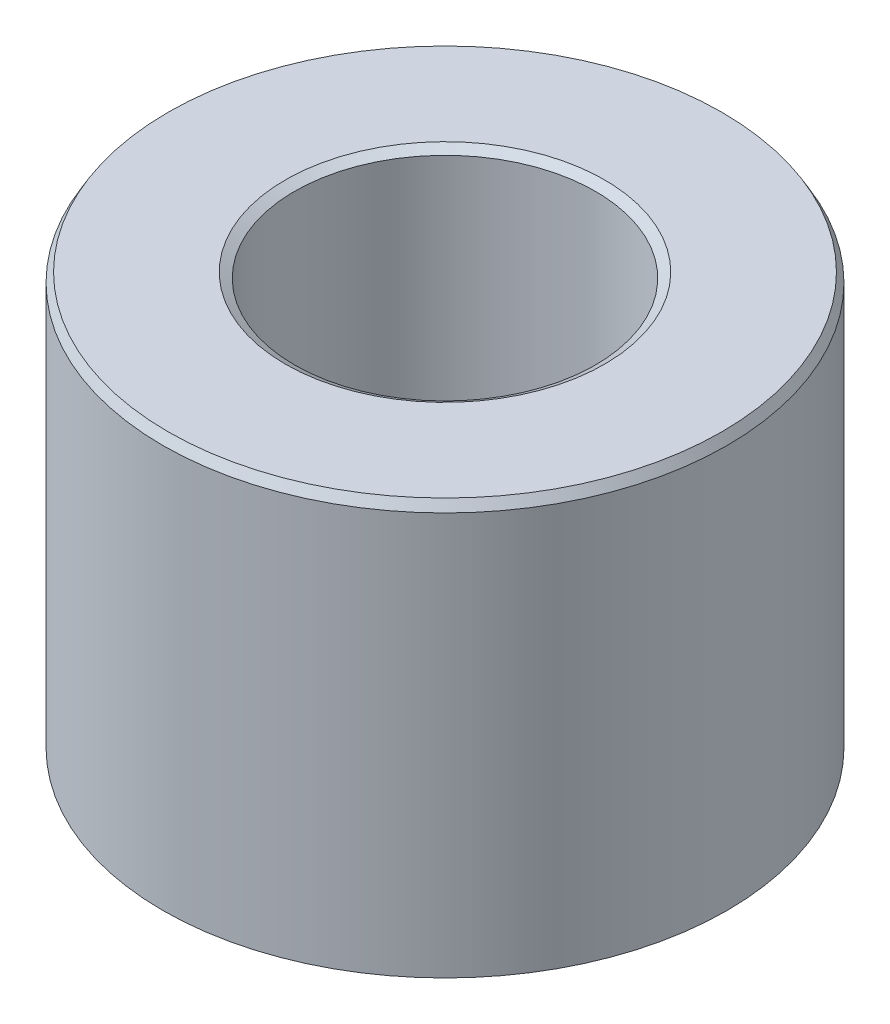
ISO-10303-21;
HEADER;
FILE_DESCRIPTION(('STEP AP214'),'2;1');
FILE_NAME('part.step','',(''),(''),'','','');
FILE_SCHEMA(('AUTOMOTIVE_DESIGN { 1 0 10303 214 1 1 1 1 }'));
ENDSEC;
DATA;
#1=APPLICATION_CONTEXT('core data for automotive mechanical design processes');
#2=APPLICATION_PROTOCOL_DEFINITION('international standard','automotive_design',2000,#1);
#3=PRODUCT_CONTEXT('',#1,'mechanical');
#4=PRODUCT('Part','Part','',(#3));
#5=PRODUCT_RELATED_PRODUCT_CATEGORY('part','',(#4));
#6=PRODUCT_DEFINITION_FORMATION('','',#4);
#7=PRODUCT_DEFINITION_CONTEXT('part definition',#1,'design');
#8=PRODUCT_DEFINITION('design','',#6,#7);
#9=PRODUCT_DEFINITION_SHAPE('','',#8);
#10=(LENGTH_UNIT() NAMED_UNIT(*) SI_UNIT(.MILLI.,.METRE.));
#11=(NAMED_UNIT(*) PLANE_ANGLE_UNIT() SI_UNIT($,.RADIAN.));
#12=(NAMED_UNIT(*) SI_UNIT($,.STERADIAN.) SOLID_ANGLE_UNIT());
#13=UNCERTAINTY_MEASURE_WITH_UNIT(LENGTH_MEASURE(1.E-05),#10,'distance_accuracy_value','');
#14=(GEOMETRIC_REPRESENTATION_CONTEXT(3) GLOBAL_UNCERTAINTY_ASSIGNED_CONTEXT((#13)) GLOBAL_UNIT_ASSIGNED_CONTEXT((#10,
#11,#12)) REPRESENTATION_CONTEXT('',''));
#15=CARTESIAN_POINT('',(0.,0.,0.));
#16=DIRECTION('',(0.,0.,1.));
#17=DIRECTION('',(1.,0.,0.));
#18=AXIS2_PLACEMENT_3D('',#15,#16,#17);
#19=CARTESIAN_POINT('',(0.,59.1531757161048,0.));
#20=DIRECTION('',(0.,-1.,0.));
#21=DIRECTION('',(0.,0.,-1.));
#22=AXIS2_PLACEMENT_3D('',#19,#20,#21);
#23=CYLINDRICAL_SURFACE('',#22,40.);
#24=CARTESIAN_POINT('',(0.,0.752338956658293,0.));
#25=DIRECTION('',(0.,1.,0.));
#26=DIRECTION('',(0.,0.,1.));
#27=AXIS2_PLACEMENT_3D('',#24,#25,#26);
#28=CIRCLE('',#27,40.);
#29=CARTESIAN_POINT('',(0.,0.752338956658293,40.));
#30=VERTEX_POINT('',#29);
#31=EDGE_CURVE('E10',#30,#30,#28,.T.);
#32=ORIENTED_EDGE('',*,*,#31,.T.);
#33=EDGE_LOOP('',(#32));
#34=FACE_BOUND('',#33,.T.);
#35=CARTESIAN_POINT('',(0.,57.8500864186592,0.));
#36=DIRECTION('',(0.,1.,0.));
#37=DIRECTION('',(0.,0.,1.));
#38=AXIS2_PLACEMENT_3D('',#35,#36,#37);
#39=CIRCLE('',#38,40.);
#40=CARTESIAN_POINT('',(0.,57.8500864186592,-40.));
#41=VERTEX_POINT('',#40);
#42=EDGE_CURVE('E50',#41,#41,#39,.F.);
#43=ORIENTED_EDGE('',*,*,#42,.T.);
#44=EDGE_LOOP('',(#43));
#45=FACE_BOUND('',#44,.T.);
#46=ADVANCED_FACE('F39',(#34,#45),#23,.T.);
#47=CARTESIAN_POINT('',(0.,59.1531757161048,0.));
#48=DIRECTION('',(0.,1.,0.));
#49=DIRECTION('',(0.,0.,1.));
#50=AXIS2_PLACEMENT_3D('',#47,#48,#49);
#51=PLANE('',#50);
#52=CARTESIAN_POINT('',(0.,59.1531757161048,0.));
#53=DIRECTION('',(0.,1.,0.));
#54=DIRECTION('',(0.,0.,1.));
#55=AXIS2_PLACEMENT_3D('',#52,#53,#54);
#56=CIRCLE('',#55,22.6349293405083);
#57=CARTESIAN_POINT('',(0.,59.1531757161048,22.6349293405083));
#58=VERTEX_POINT('',#57);
#59=EDGE_CURVE('E58',#58,#58,#56,.F.);
#60=ORIENTED_EDGE('',*,*,#59,.T.);
#61=EDGE_LOOP('',(#60));
#62=FACE_BOUND('',#61,.T.);
#63=CARTESIAN_POINT('',(0.,59.1531757161048,0.));
#64=DIRECTION('',(0.,1.,0.));
#65=DIRECTION('',(0.,0.,1.));
#66=AXIS2_PLACEMENT_3D('',#63,#64,#65);
#67=CIRCLE('',#66,39.2476610433417);
#68=CARTESIAN_POINT('',(0.,59.1531757161048,-39.2476610433417));
#69=VERTEX_POINT('',#68);
#70=EDGE_CURVE('E61',#69,#69,#67,.T.);
#71=ORIENTED_EDGE('',*,*,#70,.T.);
#72=EDGE_LOOP('',(#71));
#73=FACE_BOUND('',#72,.T.);
#74=ADVANCED_FACE('F88',(#62,#73),#51,.T.);
#75=CARTESIAN_POINT('',(0.,0.,0.));
#76=DIRECTION('',(0.,1.,0.));
#77=DIRECTION('',(0.,0.,1.));
#78=AXIS2_PLACEMENT_3D('',#75,#76,#77);
#79=PLANE('',#78);
#80=CARTESIAN_POINT('',(0.,0.,0.));
#81=DIRECTION('',(0.,1.,0.));
#82=DIRECTION('',(0.,0.,1.));
#83=AXIS2_PLACEMENT_3D('',#80,#81,#82);
#84=CIRCLE('',#83,22.084178999721);
#85=CARTESIAN_POINT('',(0.,0.,22.084178999721));
#86=VERTEX_POINT('',#85);
#87=EDGE_CURVE('E51',#86,#86,#84,.T.);
#88=ORIENTED_EDGE('',*,*,#87,.T.);
#89=EDGE_LOOP('',(#88));
#90=FACE_BOUND('',#89,.T.);
#91=CARTESIAN_POINT('',(0.,0.,0.));
#92=DIRECTION('',(0.,1.,0.));
#93=DIRECTION('',(0.,0.,1.));
#94=AXIS2_PLACEMENT_3D('',#91,#92,#93);
#95=CIRCLE('',#94,38.6969107025545);
#96=CARTESIAN_POINT('',(0.,0.,38.6969107025545));
#97=VERTEX_POINT('',#96);
#98=EDGE_CURVE('E54',#97,#97,#95,.F.);
#99=ORIENTED_EDGE('',*,*,#98,.T.);
#100=EDGE_LOOP('',(#99));
#101=FACE_BOUND('',#100,.T.);
#102=ADVANCED_FACE('F83',(#90,#101),#79,.F.);
#103=CARTESIAN_POINT('',(0.,59.1531757161048,0.));
#104=DIRECTION('',(0.,-1.,0.));
#105=DIRECTION('',(0.,0.,-1.));
#106=AXIS2_PLACEMENT_3D('',#103,#104,#105);
#107=CYLINDRICAL_SURFACE('',#106,21.3318400430627);
#108=CARTESIAN_POINT('',(0.,58.4008367594465,0.));
#109=DIRECTION('',(0.,1.,0.));
#110=DIRECTION('',(0.,0.,1.));
#111=AXIS2_PLACEMENT_3D('',#108,#109,#110);
#112=CIRCLE('',#111,21.3318400430627);
#113=CARTESIAN_POINT('',(0.,58.4008367594465,21.3318400430627));
#114=VERTEX_POINT('',#113);
#115=EDGE_CURVE('E67',#114,#114,#112,.T.);
#116=ORIENTED_EDGE('',*,*,#115,.T.);
#117=EDGE_LOOP('',(#116));
#118=FACE_BOUND('',#117,.T.);
#119=CARTESIAN_POINT('',(0.,1.30308929744555,0.));
#120=DIRECTION('',(0.,1.,0.));
#121=DIRECTION('',(0.,0.,1.));
#122=AXIS2_PLACEMENT_3D('',#119,#120,#121);
#123=CIRCLE('',#122,21.3318400430627);
#124=CARTESIAN_POINT('',(0.,1.30308929744555,21.3318400430627));
#125=VERTEX_POINT('',#124);
#126=EDGE_CURVE('E69',#125,#125,#123,.F.);
#127=ORIENTED_EDGE('',*,*,#126,.T.);
#128=EDGE_LOOP('',(#127));
#129=FACE_BOUND('',#128,.T.);
#130=ADVANCED_FACE('F71',(#118,#129),#107,.F.);
#131=CARTESIAN_POINT('',(0.,58.4008367594465,0.));
#132=DIRECTION('',(0.,1.,0.));
#133=DIRECTION('',(0.,0.,1.));
#134=AXIS2_PLACEMENT_3D('',#131,#132,#133);
#135=CONICAL_SURFACE('',#134,21.3318400430627,1.0471975511966);
#136=CARTESIAN_POINT('',(0.,59.1531757161048,22.6349293405083));
#137=CARTESIAN_POINT('',(0.,59.145338851973,22.6213554936599));
#138=CARTESIAN_POINT('',(0.,59.1375019878411,22.6077816468115));
#139=CARTESIAN_POINT('',(0.,59.1218282595774,22.5806339531147));
#140=CARTESIAN_POINT('',(0.,59.1139913954455,22.5670601062663));
#141=CARTESIAN_POINT('',(0.,59.0983176671818,22.5399124125696));
#142=CARTESIAN_POINT('',(0.,59.0904808030499,22.5263385657212));
#143=CARTESIAN_POINT('',(0.,59.0748070747862,22.4991908720244));
#144=CARTESIAN_POINT('',(0.,59.0669702106544,22.485617025176));
#145=CARTESIAN_POINT('',(0.,59.0512964823907,22.4584693314792));
#146=CARTESIAN_POINT('',(0.,59.0434596182588,22.4448954846308));
#147=CARTESIAN_POINT('',(0.,59.0277858899951,22.417747790934));
#148=CARTESIAN_POINT('',(0.,59.0199490258632,22.4041739440856));
#149=CARTESIAN_POINT('',(0.,59.0042752975995,22.3770262503889));
#150=CARTESIAN_POINT('',(0.,58.9964384334677,22.3634524035405));
#151=CARTESIAN_POINT('',(0.,58.9807647052039,22.3363047098437));
#152=CARTESIAN_POINT('',(0.,58.9729278410721,22.3227308629953));
#153=CARTESIAN_POINT('',(0.,58.9572541128084,22.2955831692985));
#154=CARTESIAN_POINT('',(0.,58.9494172486765,22.2820093224501));
#155=CARTESIAN_POINT('',(0.,58.9337435204128,22.2548616287533));
#156=CARTESIAN_POINT('',(0.,58.9259066562809,22.2412877819049));
#157=CARTESIAN_POINT('',(0.,58.9102329280172,22.2141400882082));
#158=CARTESIAN_POINT('',(0.,58.9023960638854,22.2005662413598));
#159=CARTESIAN_POINT('',(0.,58.8867223356216,22.173418547663));
#160=CARTESIAN_POINT('',(0.,58.8788854714898,22.1598447008146));
#161=CARTESIAN_POINT('',(0.,58.8632117432261,22.1326970071178));
#162=CARTESIAN_POINT('',(0.,58.8553748790942,22.1191231602694));
#163=CARTESIAN_POINT('',(0.,58.8397011508305,22.0919754665726));
#164=CARTESIAN_POINT('',(0.,58.8318642866987,22.0784016197242));
#165=CARTESIAN_POINT('',(0.,58.8161905584349,22.0512539260275));
#166=CARTESIAN_POINT('',(0.,58.8083536943031,22.0376800791791));
#167=CARTESIAN_POINT('',(0.,58.7926799660394,22.0105323854823));
#168=CARTESIAN_POINT('',(0.,58.7848431019075,21.9969585386339));
#169=CARTESIAN_POINT('',(0.,58.7691693736438,21.9698108449371));
#170=CARTESIAN_POINT('',(0.,58.7613325095119,21.9562369980887));
#171=CARTESIAN_POINT('',(0.,58.7456587812482,21.9290893043919));
#172=CARTESIAN_POINT('',(0.,58.7378219171164,21.9155154575435));
#173=CARTESIAN_POINT('',(0.,58.7221481888526,21.8883677638468));
#174=CARTESIAN_POINT('',(0.,58.7143113247208,21.8747939169984));
#175=CARTESIAN_POINT('',(0.,58.6986375964571,21.8476462233016));
#176=CARTESIAN_POINT('',(0.,58.6908007323252,21.8340723764532));
#177=CARTESIAN_POINT('',(0.,58.6751270040615,21.8069246827564));
#178=CARTESIAN_POINT('',(0.,58.6672901399296,21.793350835908));
#179=CARTESIAN_POINT('',(0.,58.6516164116659,21.7662031422112));
#180=CARTESIAN_POINT('',(0.,58.6437795475341,21.7526292953629));
#181=CARTESIAN_POINT('',(0.,58.6281058192704,21.7254816016661));
#182=CARTESIAN_POINT('',(0.,58.6202689551385,21.7119077548177));
#183=CARTESIAN_POINT('',(0.,58.6045952268748,21.6847600611209));
#184=CARTESIAN_POINT('',(0.,58.5967583627429,21.6711862142725));
#185=CARTESIAN_POINT('',(0.,58.5810846344792,21.6440385205757));
#186=CARTESIAN_POINT('',(0.,58.5732477703474,21.6304646737273));
#187=CARTESIAN_POINT('',(0.,58.5575740420836,21.6033169800305));
#188=CARTESIAN_POINT('',(0.,58.5497371779518,21.5897431331822));
#189=CARTESIAN_POINT('',(0.,58.5340634496881,21.5625954394854));
#190=CARTESIAN_POINT('',(0.,58.5262265855562,21.549021592637));
#191=CARTESIAN_POINT('',(0.,58.5105528572925,21.5218738989402));
#192=CARTESIAN_POINT('',(0.,58.5027159931606,21.5083000520918));
#193=CARTESIAN_POINT('',(0.,58.4870422648969,21.481152358395));
#194=CARTESIAN_POINT('',(0.,58.4792054007651,21.4675785115466));
#195=CARTESIAN_POINT('',(0.,58.4635316725014,21.4404308178498));
#196=CARTESIAN_POINT('',(0.,58.4556948083695,21.4268569710015));
#197=CARTESIAN_POINT('',(0.,58.4400210801058,21.3997092773047));
#198=CARTESIAN_POINT('',(0.,58.4321842159739,21.3861354304563));
#199=CARTESIAN_POINT('',(0.,58.4165104877102,21.3589877367595));
#200=CARTESIAN_POINT('',(0.,58.4086736235784,21.3454138899111));
#201=CARTESIAN_POINT('',(0.,58.4008367594465,21.3318400430627));
#202=B_SPLINE_CURVE_WITH_KNOTS('',3,(#136,#137,#138,#139,#140,#141,#142,#143,#144,#145,#146,
#147,#148,#149,#150,#151,#152,#153,#154,#155,#156,#157,#158,#159,#160,#161,#162,#163,#164,#165,
#166,#167,#168,#169,#170,#171,#172,#173,#174,#175,#176,#177,#178,#179,#180,#181,#182,#183,#184,
#185,#186,#187,#188,#189,#190,#191,#192,#193,#194,#195,#196,#197,#198,#199,#200,#201),
.UNSPECIFIED.,.F.,.F.,(4,2,2,2,2,2,2,2,2,2,2,2,2,2,2,2,2,2,2,2,2,2,2,2,2,2,2,2,2,2,2,2,4),(0.,
0.0470211847911439,0.0940423695822908,0.141063554373438,0.188084739164581,0.235105923955728,
0.282127108746872,0.329148293538015,0.376169478329162,0.423190663120309,0.470211847911449,
0.517233032702596,0.564254217493743,0.611275402284887,0.658296587076033,0.705317771867177,
0.752338956658321,0.799360141449468,0.846381326240614,0.893402511031758,0.940423695822902,
0.987444880614049,1.0344660654052,1.08148725019634,1.12850843498748,1.17552961977863,
1.22255080456977,1.26957198936092,1.31659317415207,1.36361435894321,1.41063554373435,
1.4576567285255,1.50467791331665),.UNSPECIFIED.);
#203=EDGE_CURVE('BSEAM77',#58,#114,#202,.T.);
#204=ORIENTED_EDGE('',*,*,#59,.F.);
#205=ORIENTED_EDGE('',*,*,#115,.F.);
#206=ORIENTED_EDGE('',*,*,#203,.T.);
#207=ORIENTED_EDGE('',*,*,#203,.F.);
#208=EDGE_LOOP('',(#204,#206,#205,#207));
#209=FACE_BOUND('',#208,.T.);
#210=ADVANCED_FACE('F77',(#209),#135,.F.);
#211=CARTESIAN_POINT('',(0.,0.,0.));
#212=DIRECTION('',(0.,-1.,0.));
#213=DIRECTION('',(0.,0.,-1.));
#214=AXIS2_PLACEMENT_3D('',#211,#212,#213);
#215=CONICAL_SURFACE('',#214,22.084178999721,0.523598775598298);
#216=ORIENTED_EDGE('',*,*,#126,.F.);
#217=EDGE_LOOP('',(#216));
#218=FACE_BOUND('',#217,.T.);
#219=ORIENTED_EDGE('',*,*,#87,.F.);
#220=EDGE_LOOP('',(#219));
#221=FACE_BOUND('',#220,.T.);
#222=ADVANCED_FACE('F73',(#218,#221),#215,.F.);
#223=CARTESIAN_POINT('',(0.,0.752338956658293,0.));
#224=DIRECTION('',(0.,1.,0.));
#225=DIRECTION('',(0.,0.,1.));
#226=AXIS2_PLACEMENT_3D('',#223,#224,#225);
#227=CONICAL_SURFACE('',#226,40.,1.0471975511966);
#228=ORIENTED_EDGE('',*,*,#98,.F.);
#229=EDGE_LOOP('',(#228));
#230=FACE_BOUND('',#229,.T.);
#231=ORIENTED_EDGE('',*,*,#31,.F.);
#232=EDGE_LOOP('',(#231));
#233=FACE_BOUND('',#232,.T.);
#234=ADVANCED_FACE('F76',(#230,#233),#227,.T.);
#235=CARTESIAN_POINT('',(0.,59.1531757161048,0.));
#236=DIRECTION('',(0.,-1.,0.));
#237=DIRECTION('',(0.,0.,-1.));
#238=AXIS2_PLACEMENT_3D('',#235,#236,#237);
#239=CONICAL_SURFACE('',#238,39.2476610433417,0.52359877559829);
#240=CARTESIAN_POINT('',(0.,57.8500864186592,-40.));
#241=CARTESIAN_POINT('',(0.,57.8636602655076,-39.9921631358681));
#242=CARTESIAN_POINT('',(0.,57.877234112356,-39.9843262717363));
#243=CARTESIAN_POINT('',(0.,57.9043818060528,-39.9686525434726));
#244=CARTESIAN_POINT('',(0.,57.9179556529012,-39.9608156793407));
#245=CARTESIAN_POINT('',(0.,57.9451033465979,-39.945141951077));
#246=CARTESIAN_POINT('',(0.,57.9586771934463,-39.9373050869451));
#247=CARTESIAN_POINT('',(0.,57.9858248871431,-39.9216313586814));
#248=CARTESIAN_POINT('',(0.,57.9993987339915,-39.9137944945496));
#249=CARTESIAN_POINT('',(0.,58.0265464276883,-39.8981207662859));
#250=CARTESIAN_POINT('',(0.,58.0401202745367,-39.890283902154));
#251=CARTESIAN_POINT('',(0.,58.0672679682335,-39.8746101738903));
#252=CARTESIAN_POINT('',(0.,58.0808418150819,-39.8667733097584));
#253=CARTESIAN_POINT('',(0.,58.1079895087787,-39.8510995814947));
#254=CARTESIAN_POINT('',(0.,58.121563355627,-39.8432627173629));
#255=CARTESIAN_POINT('',(0.,58.1487110493238,-39.8275889890991));
#256=CARTESIAN_POINT('',(0.,58.1622848961722,-39.8197521249673));
#257=CARTESIAN_POINT('',(0.,58.189432589869,-39.8040783967036));
#258=CARTESIAN_POINT('',(0.,58.2030064367174,-39.7962415325717));
#259=CARTESIAN_POINT('',(0.,58.2301541304142,-39.780567804308));
#260=CARTESIAN_POINT('',(0.,58.2437279772626,-39.7727309401761));
#261=CARTESIAN_POINT('',(0.,58.2708756709593,-39.7570572119124));
#262=CARTESIAN_POINT('',(0.,58.2844495178077,-39.7492203477806));
#263=CARTESIAN_POINT('',(0.,58.3115972115045,-39.7335466195169));
#264=CARTESIAN_POINT('',(0.,58.3251710583529,-39.725709755385));
#265=CARTESIAN_POINT('',(0.,58.3523187520497,-39.7100360271213));
#266=CARTESIAN_POINT('',(0.,58.3658925988981,-39.7021991629894));
#267=CARTESIAN_POINT('',(0.,58.3930402925949,-39.6865254347257));
#268=CARTESIAN_POINT('',(0.,58.4066141394433,-39.6786885705938));
#269=CARTESIAN_POINT('',(0.,58.4337618331401,-39.6630148423301));
#270=CARTESIAN_POINT('',(0.,58.4473356799884,-39.6551779781983));
#271=CARTESIAN_POINT('',(0.,58.4744833736852,-39.6395042499346));
#272=CARTESIAN_POINT('',(0.,58.4880572205336,-39.6316673858027));
#273=CARTESIAN_POINT('',(0.,58.5152049142304,-39.615993657539));
#274=CARTESIAN_POINT('',(0.,58.5287787610788,-39.6081567934071));
#275=CARTESIAN_POINT('',(0.,58.5559264547756,-39.5924830651434));
#276=CARTESIAN_POINT('',(0.,58.569500301624,-39.5846462010116));
#277=CARTESIAN_POINT('',(0.,58.5966479953208,-39.5689724727478));
#278=CARTESIAN_POINT('',(0.,58.6102218421691,-39.561135608616));
#279=CARTESIAN_POINT('',(0.,58.6373695358659,-39.5454618803523));
#280=CARTESIAN_POINT('',(0.,58.6509433827143,-39.5376250162204));
#281=CARTESIAN_POINT('',(0.,58.6780910764111,-39.5219512879567));
#282=CARTESIAN_POINT('',(0.,58.6916649232595,-39.5141144238248));
#283=CARTESIAN_POINT('',(0.,58.7188126169563,-39.4984406955611));
#284=CARTESIAN_POINT('',(0.,58.7323864638047,-39.4906038314293));
#285=CARTESIAN_POINT('',(0.,58.7595341575014,-39.4749301031655));
#286=CARTESIAN_POINT('',(0.,58.7731080043498,-39.4670932390337));
#287=CARTESIAN_POINT('',(0.,58.8002556980466,-39.45141951077));
#288=CARTESIAN_POINT('',(0.,58.813829544895,-39.4435826466381));
#289=CARTESIAN_POINT('',(0.,58.8409772385918,-39.4279089183744));
#290=CARTESIAN_POINT('',(0.,58.8545510854402,-39.4200720542425));
#291=CARTESIAN_POINT('',(0.,58.881698779137,-39.4043983259788));
#292=CARTESIAN_POINT('',(0.,58.8952726259854,-39.396561461847));
#293=CARTESIAN_POINT('',(0.,58.9224203196822,-39.3808877335833));
#294=CARTESIAN_POINT('',(0.,58.9359941665305,-39.3730508694514));
#295=CARTESIAN_POINT('',(0.,58.9631418602273,-39.3573771411877));
#296=CARTESIAN_POINT('',(0.,58.9767157070757,-39.3495402770558));
#297=CARTESIAN_POINT('',(0.,59.0038634007725,-39.3338665487921));
#298=CARTESIAN_POINT('',(0.,59.0174372476209,-39.3260296846602));
#299=CARTESIAN_POINT('',(0.,59.0445849413177,-39.3103559563965));
#300=CARTESIAN_POINT('',(0.,59.0581587881661,-39.3025190922647));
#301=CARTESIAN_POINT('',(0.,59.0853064818629,-39.286845364001));
#302=CARTESIAN_POINT('',(0.,59.0988803287112,-39.2790084998691));
#303=CARTESIAN_POINT('',(0.,59.126028022408,-39.2633347716054));
#304=CARTESIAN_POINT('',(0.,59.1396018692564,-39.2554979074735));
#305=CARTESIAN_POINT('',(0.,59.1531757161048,-39.2476610433417));
#306=B_SPLINE_CURVE_WITH_KNOTS('',3,(#240,#241,#242,#243,#244,#245,#246,#247,#248,#249,#250,
#251,#252,#253,#254,#255,#256,#257,#258,#259,#260,#261,#262,#263,#264,#265,#266,#267,#268,#269,
#270,#271,#272,#273,#274,#275,#276,#277,#278,#279,#280,#281,#282,#283,#284,#285,#286,#287,#288,
#289,#290,#291,#292,#293,#294,#295,#296,#297,#298,#299,#300,#301,#302,#303,#304,#305),
.UNSPECIFIED.,.F.,.F.,(4,2,2,2,2,2,2,2,2,2,2,2,2,2,2,2,2,2,2,2,2,2,2,2,2,2,2,2,2,2,2,2,4),(0.,
0.0470211847911464,0.0940423695822903,0.14106355437344,0.188084739164584,0.23510592395573,
0.282127108746874,0.329148293538024,0.376169478329165,0.423190663120315,0.470211847911458,
0.517233032702608,0.564254217493749,0.611275402284899,0.658296587076043,0.705317771867189,
0.752338956658333,0.799360141449477,0.846381326240627,0.893402511031767,0.940423695822917,
0.987444880614061,1.03446606540521,1.08148725019635,1.1285084349875,1.17552961977865,
1.22255080456979,1.26957198936094,1.31659317415209,1.36361435894323,1.41063554373438,
1.45765672852552,1.50467791331667),.UNSPECIFIED.);
#307=EDGE_CURVE('BSEAM45',#41,#69,#306,.T.);
#308=ORIENTED_EDGE('',*,*,#42,.F.);
#309=ORIENTED_EDGE('',*,*,#70,.F.);
#310=ORIENTED_EDGE('',*,*,#307,.T.);
#311=ORIENTED_EDGE('',*,*,#307,.F.);
#312=EDGE_LOOP('',(#308,#310,#309,#311));
#313=FACE_BOUND('',#312,.T.);
#314=ADVANCED_FACE('F45',(#313),#239,.T.);
#315=CLOSED_SHELL('',(#46,#74,#102,#130,#210,#222,#234,#314));
#316=MANIFOLD_SOLID_BREP('B2',#315);
#317=ADVANCED_BREP_SHAPE_REPRESENTATION('',(#18,#316),#14);
#318=SHAPE_DEFINITION_REPRESENTATION(#9,#317);
ENDSEC;
END-ISO-10303-21;
